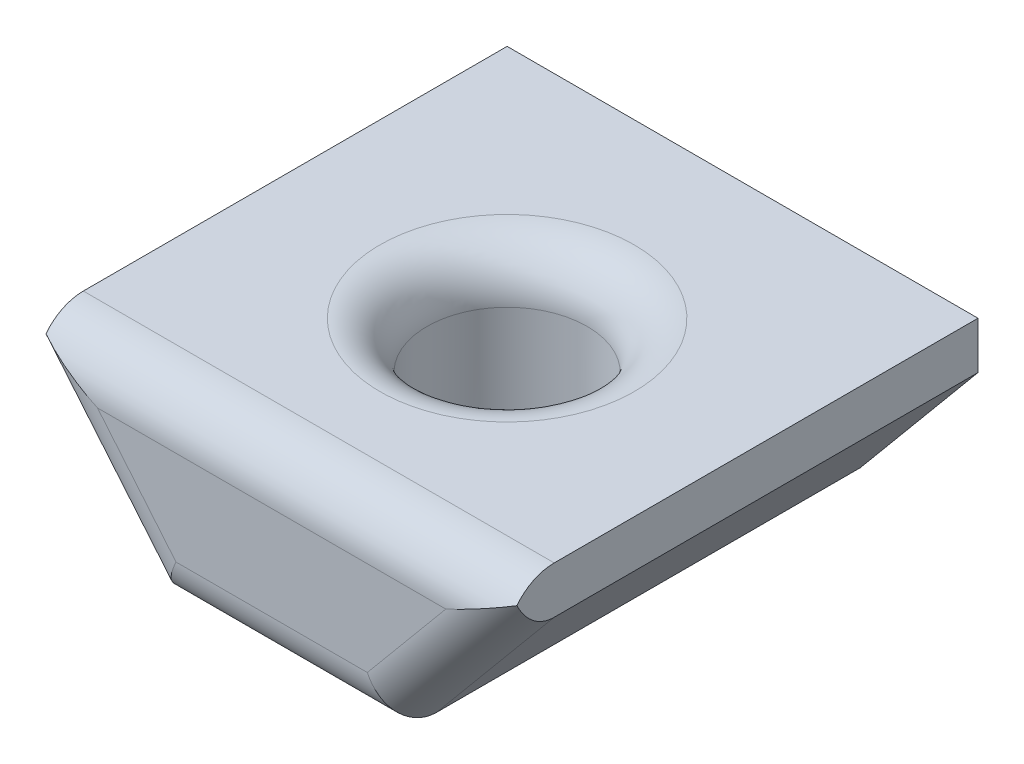
ISO-10303-21;
HEADER;
FILE_DESCRIPTION(('STEP AP214'),'2;1');
FILE_NAME('part.step','',(''),(''),'','','');
FILE_SCHEMA(('AUTOMOTIVE_DESIGN { 1 0 10303 214 1 1 1 1 }'));
ENDSEC;
DATA;
#1=APPLICATION_CONTEXT('core data for automotive mechanical design processes');
#2=APPLICATION_PROTOCOL_DEFINITION('international standard','automotive_design',2000,#1);
#3=PRODUCT_CONTEXT('',#1,'mechanical');
#4=PRODUCT('Part','Part','',(#3));
#5=PRODUCT_RELATED_PRODUCT_CATEGORY('part','',(#4));
#6=PRODUCT_DEFINITION_FORMATION('','',#4);
#7=PRODUCT_DEFINITION_CONTEXT('part definition',#1,'design');
#8=PRODUCT_DEFINITION('design','',#6,#7);
#9=PRODUCT_DEFINITION_SHAPE('','',#8);
#10=(LENGTH_UNIT() NAMED_UNIT(*) SI_UNIT(.MILLI.,.METRE.));
#11=(NAMED_UNIT(*) PLANE_ANGLE_UNIT() SI_UNIT($,.RADIAN.));
#12=(NAMED_UNIT(*) SI_UNIT($,.STERADIAN.) SOLID_ANGLE_UNIT());
#13=UNCERTAINTY_MEASURE_WITH_UNIT(LENGTH_MEASURE(1.E-05),#10,'distance_accuracy_value','');
#14=(GEOMETRIC_REPRESENTATION_CONTEXT(3) GLOBAL_UNCERTAINTY_ASSIGNED_CONTEXT((#13)) GLOBAL_UNIT_ASSIGNED_CONTEXT((#10,
#11,#12)) REPRESENTATION_CONTEXT('',''));
#15=CARTESIAN_POINT('',(0.,0.,0.));
#16=DIRECTION('',(0.,0.,1.));
#17=DIRECTION('',(1.,0.,0.));
#18=AXIS2_PLACEMENT_3D('',#15,#16,#17);
#19=CARTESIAN_POINT('',(2.5,0.,10.));
#20=DIRECTION('',(-0.768221279597376,0.64018439966448,0.));
#21=DIRECTION('',(-0.64018439966448,-0.768221279597376,0.));
#22=AXIS2_PLACEMENT_3D('',#19,#20,#21);
#23=PLANE('',#22);
#24=DIRECTION('',(0.,0.,-1.));
#25=VECTOR('',#24,1.);
#26=CARTESIAN_POINT('',(5.,3.,10.));
#27=LINE('',#26,#25);
#28=CARTESIAN_POINT('',(5.,3.,9.));
#29=VERTEX_POINT('',#28);
#30=CARTESIAN_POINT('',(5.,3.,0.));
#31=VERTEX_POINT('',#30);
#32=EDGE_CURVE('E112',#29,#31,#27,.T.);
#33=ORIENTED_EDGE('',*,*,#32,.F.);
#34=DIRECTION('',(0.64018439966448,0.768221279597376,0.));
#35=VECTOR('',#34,1.);
#36=CARTESIAN_POINT('',(2.5,0.,9.));
#37=LINE('',#36,#35);
#38=CARTESIAN_POINT('',(2.5,0.,9.));
#39=VERTEX_POINT('',#38);
#40=EDGE_CURVE('E194',#29,#39,#37,.F.);
#41=ORIENTED_EDGE('',*,*,#40,.T.);
#42=DIRECTION('',(0.,0.,-1.));
#43=VECTOR('',#42,1.);
#44=CARTESIAN_POINT('',(2.5,0.,10.));
#45=LINE('',#44,#43);
#46=CARTESIAN_POINT('',(2.5,0.,0.));
#47=VERTEX_POINT('',#46);
#48=EDGE_CURVE('E138',#39,#47,#45,.T.);
#49=ORIENTED_EDGE('',*,*,#48,.T.);
#50=DIRECTION('',(0.64018439966448,0.768221279597376,0.));
#51=VECTOR('',#50,1.);
#52=CARTESIAN_POINT('',(2.5,0.,0.));
#53=LINE('',#52,#51);
#54=EDGE_CURVE('E131',#47,#31,#53,.T.);
#55=ORIENTED_EDGE('',*,*,#54,.T.);
#56=EDGE_LOOP('',(#33,#41,#49,#55));
#57=FACE_BOUND('',#56,.T.);
#58=ADVANCED_FACE('F39',(#57),#23,.F.);
#59=CARTESIAN_POINT('',(5.,3.,10.));
#60=DIRECTION('',(-1.,0.,0.));
#61=DIRECTION('',(0.,-1.,0.));
#62=AXIS2_PLACEMENT_3D('',#59,#60,#61);
#63=PLANE('',#62);
#64=CARTESIAN_POINT('',(5.,3.,9.));
#65=DIRECTION('',(-1.,0.,0.));
#66=DIRECTION('',(0.,-1.,0.));
#67=AXIS2_PLACEMENT_3D('',#64,#65,#66);
#68=CIRCLE('',#67,1.);
#69=CARTESIAN_POINT('',(5.,4.,9.));
#70=VERTEX_POINT('',#69);
#71=CARTESIAN_POINT('',(5.,3.60968754501296,9.79264184689938));
#72=VERTEX_POINT('',#71);
#73=EDGE_CURVE('E189',#70,#72,#68,.F.);
#74=ORIENTED_EDGE('',*,*,#73,.T.);
#75=CARTESIAN_POINT('',(5.,4.56204993518133,9.));
#76=DIRECTION('',(-1.,0.,0.));
#77=DIRECTION('',(0.,-1.,0.));
#78=AXIS2_PLACEMENT_3D('',#75,#76,#77);
#79=ELLIPSE('',#78,1.56204993518133,1.);
#80=EDGE_CURVE('E119',#72,#29,#79,.F.);
#81=ORIENTED_EDGE('',*,*,#80,.T.);
#82=ORIENTED_EDGE('',*,*,#32,.T.);
#83=DIRECTION('',(0.,1.,0.));
#84=VECTOR('',#83,1.);
#85=CARTESIAN_POINT('',(5.,3.,0.));
#86=LINE('',#85,#84);
#87=CARTESIAN_POINT('',(5.,4.,0.));
#88=VERTEX_POINT('',#87);
#89=EDGE_CURVE('E116',#31,#88,#86,.T.);
#90=ORIENTED_EDGE('',*,*,#89,.T.);
#91=DIRECTION('',(0.,0.,-1.));
#92=VECTOR('',#91,1.);
#93=CARTESIAN_POINT('',(5.,4.,10.));
#94=LINE('',#93,#92);
#95=EDGE_CURVE('E125',#70,#88,#94,.T.);
#96=ORIENTED_EDGE('',*,*,#95,.F.);
#97=EDGE_LOOP('',(#74,#81,#82,#90,#96));
#98=FACE_BOUND('',#97,.T.);
#99=ADVANCED_FACE('F114',(#98),#63,.F.);
#100=CARTESIAN_POINT('',(5.,4.,10.));
#101=DIRECTION('',(0.,-1.,0.));
#102=DIRECTION('',(0.,0.,-1.));
#103=AXIS2_PLACEMENT_3D('',#100,#101,#102);
#104=PLANE('',#103);
#105=CARTESIAN_POINT('',(0.,4.,5.));
#106=DIRECTION('',(0.,-1.,0.));
#107=DIRECTION('',(0.,0.,-1.));
#108=AXIS2_PLACEMENT_3D('',#105,#106,#107);
#109=CIRCLE('',#108,2.7);
#110=CARTESIAN_POINT('',(0.,4.,2.3));
#111=VERTEX_POINT('',#110);
#112=EDGE_CURVE('E204',#111,#111,#109,.T.);
#113=ORIENTED_EDGE('',*,*,#112,.T.);
#114=EDGE_LOOP('',(#113));
#115=FACE_BOUND('',#114,.T.);
#116=DIRECTION('',(0.,0.,-1.));
#117=VECTOR('',#116,1.);
#118=CARTESIAN_POINT('',(-5.,4.,10.));
#119=LINE('',#118,#117);
#120=CARTESIAN_POINT('',(-5.,4.,9.));
#121=VERTEX_POINT('',#120);
#122=CARTESIAN_POINT('',(-5.,4.,0.));
#123=VERTEX_POINT('',#122);
#124=EDGE_CURVE('E168',#121,#123,#119,.T.);
#125=ORIENTED_EDGE('',*,*,#124,.F.);
#126=DIRECTION('',(-1.,0.,0.));
#127=VECTOR('',#126,1.);
#128=CARTESIAN_POINT('',(5.,4.,9.));
#129=LINE('',#128,#127);
#130=EDGE_CURVE('E49',#121,#70,#129,.F.);
#131=ORIENTED_EDGE('',*,*,#130,.T.);
#132=ORIENTED_EDGE('',*,*,#95,.T.);
#133=DIRECTION('',(-1.,0.,0.));
#134=VECTOR('',#133,1.);
#135=CARTESIAN_POINT('',(5.,4.,0.));
#136=LINE('',#135,#134);
#137=EDGE_CURVE('E134',#88,#123,#136,.T.);
#138=ORIENTED_EDGE('',*,*,#137,.T.);
#139=EDGE_LOOP('',(#125,#131,#132,#138));
#140=FACE_BOUND('',#139,.T.);
#141=ADVANCED_FACE('F235',(#115,#140),#104,.F.);
#142=CARTESIAN_POINT('',(-5.,3.,10.));
#143=DIRECTION('',(1.,0.,0.));
#144=DIRECTION('',(0.,1.,0.));
#145=AXIS2_PLACEMENT_3D('',#142,#143,#144);
#146=PLANE('',#145);
#147=DIRECTION('',(0.,0.,-1.));
#148=VECTOR('',#147,1.);
#149=CARTESIAN_POINT('',(-5.,3.,10.));
#150=LINE('',#149,#148);
#151=CARTESIAN_POINT('',(-5.,3.,9.));
#152=VERTEX_POINT('',#151);
#153=CARTESIAN_POINT('',(-5.,3.,0.));
#154=VERTEX_POINT('',#153);
#155=EDGE_CURVE('E165',#152,#154,#150,.T.);
#156=ORIENTED_EDGE('',*,*,#155,.F.);
#157=CARTESIAN_POINT('',(-5.,4.56204993518133,9.));
#158=DIRECTION('',(1.,0.,0.));
#159=DIRECTION('',(0.,1.,0.));
#160=AXIS2_PLACEMENT_3D('',#157,#158,#159);
#161=ELLIPSE('',#160,1.56204993518133,1.);
#162=CARTESIAN_POINT('',(-5.,3.60968754501296,9.79264184689938));
#163=VERTEX_POINT('',#162);
#164=EDGE_CURVE('E57',#152,#163,#161,.F.);
#165=ORIENTED_EDGE('',*,*,#164,.T.);
#166=CARTESIAN_POINT('',(-5.,3.,9.));
#167=DIRECTION('',(1.,0.,0.));
#168=DIRECTION('',(0.,1.,0.));
#169=AXIS2_PLACEMENT_3D('',#166,#167,#168);
#170=CIRCLE('',#169,1.);
#171=EDGE_CURVE('E61',#163,#121,#170,.F.);
#172=ORIENTED_EDGE('',*,*,#171,.T.);
#173=ORIENTED_EDGE('',*,*,#124,.T.);
#174=DIRECTION('',(0.,-1.,0.));
#175=VECTOR('',#174,1.);
#176=CARTESIAN_POINT('',(-5.,3.,0.));
#177=LINE('',#176,#175);
#178=EDGE_CURVE('E149',#123,#154,#177,.T.);
#179=ORIENTED_EDGE('',*,*,#178,.T.);
#180=EDGE_LOOP('',(#156,#165,#172,#173,#179));
#181=FACE_BOUND('',#180,.T.);
#182=ADVANCED_FACE('F247',(#181),#146,.F.);
#183=CARTESIAN_POINT('',(-2.5,0.,10.));
#184=DIRECTION('',(0.768221279597376,0.64018439966448,0.));
#185=DIRECTION('',(-0.64018439966448,0.768221279597376,0.));
#186=AXIS2_PLACEMENT_3D('',#183,#184,#185);
#187=PLANE('',#186);
#188=DIRECTION('',(0.,0.,-1.));
#189=VECTOR('',#188,1.);
#190=CARTESIAN_POINT('',(-2.5,0.,10.));
#191=LINE('',#190,#189);
#192=CARTESIAN_POINT('',(-2.5,0.,9.));
#193=VERTEX_POINT('',#192);
#194=CARTESIAN_POINT('',(-2.5,0.,0.));
#195=VERTEX_POINT('',#194);
#196=EDGE_CURVE('E162',#193,#195,#191,.T.);
#197=ORIENTED_EDGE('',*,*,#196,.F.);
#198=DIRECTION('',(0.64018439966448,-0.768221279597376,0.));
#199=VECTOR('',#198,1.);
#200=CARTESIAN_POINT('',(-5.,3.,9.));
#201=LINE('',#200,#199);
#202=EDGE_CURVE('E197',#193,#152,#201,.F.);
#203=ORIENTED_EDGE('',*,*,#202,.T.);
#204=ORIENTED_EDGE('',*,*,#155,.T.);
#205=DIRECTION('',(0.64018439966448,-0.768221279597376,0.));
#206=VECTOR('',#205,1.);
#207=CARTESIAN_POINT('',(-2.5,0.,0.));
#208=LINE('',#207,#206);
#209=EDGE_CURVE('E153',#154,#195,#208,.T.);
#210=ORIENTED_EDGE('',*,*,#209,.T.);
#211=EDGE_LOOP('',(#197,#203,#204,#210));
#212=FACE_BOUND('',#211,.T.);
#213=ADVANCED_FACE('F246',(#212),#187,.F.);
#214=CARTESIAN_POINT('',(-2.5,0.,10.));
#215=DIRECTION('',(0.,1.,0.));
#216=DIRECTION('',(0.,0.,1.));
#217=AXIS2_PLACEMENT_3D('',#214,#215,#216);
#218=PLANE('',#217);
#219=CARTESIAN_POINT('',(0.,0.,5.));
#220=DIRECTION('',(0.,1.,0.));
#221=DIRECTION('',(0.,0.,1.));
#222=AXIS2_PLACEMENT_3D('',#219,#220,#221);
#223=CIRCLE('',#222,1.7);
#224=CARTESIAN_POINT('',(0.,0.,6.7));
#225=VERTEX_POINT('',#224);
#226=EDGE_CURVE('E141',#225,#225,#223,.T.);
#227=ORIENTED_EDGE('',*,*,#226,.T.);
#228=EDGE_LOOP('',(#227));
#229=FACE_BOUND('',#228,.T.);
#230=ORIENTED_EDGE('',*,*,#48,.F.);
#231=DIRECTION('',(1.,0.,0.));
#232=VECTOR('',#231,1.);
#233=CARTESIAN_POINT('',(-2.5,0.,9.));
#234=LINE('',#233,#232);
#235=EDGE_CURVE('E185',#39,#193,#234,.F.);
#236=ORIENTED_EDGE('',*,*,#235,.T.);
#237=ORIENTED_EDGE('',*,*,#196,.T.);
#238=DIRECTION('',(1.,0.,0.));
#239=VECTOR('',#238,1.);
#240=CARTESIAN_POINT('',(-2.5,0.,0.));
#241=LINE('',#240,#239);
#242=EDGE_CURVE('E157',#195,#47,#241,.T.);
#243=ORIENTED_EDGE('',*,*,#242,.T.);
#244=EDGE_LOOP('',(#230,#236,#237,#243));
#245=FACE_BOUND('',#244,.T.);
#246=ADVANCED_FACE('F240',(#229,#245),#218,.F.);
#247=CARTESIAN_POINT('',(0.,0.,10.));
#248=DIRECTION('',(0.,0.,1.));
#249=DIRECTION('',(1.,0.,0.));
#250=AXIS2_PLACEMENT_3D('',#247,#248,#249);
#251=PLANE('',#250);
#252=DIRECTION('',(0.64018439966448,-0.768221279597376,0.));
#253=VECTOR('',#252,1.);
#254=CARTESIAN_POINT('',(-1.73177872040262,0.64018439966448,10.));
#255=LINE('',#254,#253);
#256=CARTESIAN_POINT('',(-3.69829172068223,3.,10.));
#257=VERTEX_POINT('',#256);
#258=CARTESIAN_POINT('',(-2.03162505401556,1.,10.));
#259=VERTEX_POINT('',#258);
#260=EDGE_CURVE('E175',#257,#259,#255,.T.);
#261=ORIENTED_EDGE('',*,*,#260,.T.);
#262=DIRECTION('',(1.,0.,0.));
#263=VECTOR('',#262,1.);
#264=CARTESIAN_POINT('',(2.5,1.,10.));
#265=LINE('',#264,#263);
#266=CARTESIAN_POINT('',(2.03162505401556,1.,10.));
#267=VERTEX_POINT('',#266);
#268=EDGE_CURVE('E181',#259,#267,#265,.T.);
#269=ORIENTED_EDGE('',*,*,#268,.T.);
#270=DIRECTION('',(0.64018439966448,0.768221279597376,0.));
#271=VECTOR('',#270,1.);
#272=CARTESIAN_POINT('',(4.23177872040262,3.64018439966448,10.));
#273=LINE('',#272,#271);
#274=CARTESIAN_POINT('',(3.69829172068222,3.,10.));
#275=VERTEX_POINT('',#274);
#276=EDGE_CURVE('E178',#267,#275,#273,.T.);
#277=ORIENTED_EDGE('',*,*,#276,.T.);
#278=DIRECTION('',(-1.,0.,0.));
#279=VECTOR('',#278,1.);
#280=CARTESIAN_POINT('',(-5.,3.,10.));
#281=LINE('',#280,#279);
#282=EDGE_CURVE('E124',#275,#257,#281,.T.);
#283=ORIENTED_EDGE('',*,*,#282,.T.);
#284=EDGE_LOOP('',(#261,#269,#277,#283));
#285=FACE_BOUND('',#284,.T.);
#286=ADVANCED_FACE('F280',(#285),#251,.T.);
#287=CARTESIAN_POINT('',(0.,0.,0.));
#288=DIRECTION('',(0.,0.,1.));
#289=DIRECTION('',(1.,0.,0.));
#290=AXIS2_PLACEMENT_3D('',#287,#288,#289);
#291=PLANE('',#290);
#292=ORIENTED_EDGE('',*,*,#54,.F.);
#293=ORIENTED_EDGE('',*,*,#242,.F.);
#294=ORIENTED_EDGE('',*,*,#209,.F.);
#295=ORIENTED_EDGE('',*,*,#178,.F.);
#296=ORIENTED_EDGE('',*,*,#137,.F.);
#297=ORIENTED_EDGE('',*,*,#89,.F.);
#298=EDGE_LOOP('',(#292,#293,#294,#295,#296,#297));
#299=FACE_BOUND('',#298,.T.);
#300=ADVANCED_FACE('F129',(#299),#291,.F.);
#301=CARTESIAN_POINT('',(0.,0.,5.));
#302=DIRECTION('',(0.,1.,0.));
#303=DIRECTION('',(0.,0.,1.));
#304=AXIS2_PLACEMENT_3D('',#301,#302,#303);
#305=CYLINDRICAL_SURFACE('',#304,1.7);
#306=CARTESIAN_POINT('',(0.,3.,5.));
#307=DIRECTION('',(0.,-1.,0.));
#308=DIRECTION('',(0.,0.,-1.));
#309=AXIS2_PLACEMENT_3D('',#306,#307,#308);
#310=CIRCLE('',#309,1.7);
#311=CARTESIAN_POINT('',(0.,3.,3.3));
#312=VERTEX_POINT('',#311);
#313=EDGE_CURVE('E11',#312,#312,#310,.F.);
#314=ORIENTED_EDGE('',*,*,#313,.T.);
#315=EDGE_LOOP('',(#314));
#316=FACE_BOUND('',#315,.T.);
#317=ORIENTED_EDGE('',*,*,#226,.F.);
#318=EDGE_LOOP('',(#317));
#319=FACE_BOUND('',#318,.T.);
#320=ADVANCED_FACE('F271',(#316,#319),#305,.F.);
#321=CARTESIAN_POINT('',(0.,3.,9.));
#322=DIRECTION('',(1.,0.,0.));
#323=DIRECTION('',(0.,0.,-1.));
#324=AXIS2_PLACEMENT_3D('',#321,#322,#323);
#325=CYLINDRICAL_SURFACE('',#324,1.);
#326=ORIENTED_EDGE('',*,*,#130,.F.);
#327=ORIENTED_EDGE('',*,*,#171,.F.);
#328=CARTESIAN_POINT('',(-3.69829172068222,3.,9.));
#329=DIRECTION('',(0.424155396249724,0.90558942122368,0.));
#330=DIRECTION('',(-0.90558942122368,0.424155396249724,0.));
#331=AXIS2_PLACEMENT_3D('',#328,#329,#330);
#332=ELLIPSE('',#331,2.35762649453891,1.);
#333=EDGE_CURVE('E43',#257,#163,#332,.F.);
#334=ORIENTED_EDGE('',*,*,#333,.F.);
#335=ORIENTED_EDGE('',*,*,#282,.F.);
#336=CARTESIAN_POINT('',(3.69829172068222,3.,9.));
#337=DIRECTION('',(0.424155396249724,-0.90558942122368,0.));
#338=DIRECTION('',(0.90558942122368,0.424155396249724,0.));
#339=AXIS2_PLACEMENT_3D('',#336,#337,#338);
#340=ELLIPSE('',#339,2.35762649453891,1.);
#341=EDGE_CURVE('E215',#72,#275,#340,.T.);
#342=ORIENTED_EDGE('',*,*,#341,.F.);
#343=ORIENTED_EDGE('',*,*,#73,.F.);
#344=EDGE_LOOP('',(#326,#327,#334,#335,#342,#343));
#345=FACE_BOUND('',#344,.T.);
#346=ADVANCED_FACE('F232',(#345),#325,.T.);
#347=CARTESIAN_POINT('',(-0.707188556468198,-0.589323797056832,9.));
#348=DIRECTION('',(-0.64018439966448,0.768221279597376,0.));
#349=DIRECTION('',(-0.768221279597376,-0.64018439966448,0.));
#350=AXIS2_PLACEMENT_3D('',#347,#348,#349);
#351=CYLINDRICAL_SURFACE('',#350,1.);
#352=ORIENTED_EDGE('',*,*,#164,.F.);
#353=ORIENTED_EDGE('',*,*,#202,.F.);
#354=CARTESIAN_POINT('',(-2.03162505401556,1.,9.));
#355=DIRECTION('',(-0.90558942122368,0.424155396249724,0.));
#356=DIRECTION('',(0.424155396249724,0.90558942122368,0.));
#357=AXIS2_PLACEMENT_3D('',#354,#355,#356);
#358=ELLIPSE('',#357,1.10425318203115,1.);
#359=EDGE_CURVE('E213',#259,#193,#358,.F.);
#360=ORIENTED_EDGE('',*,*,#359,.F.);
#361=ORIENTED_EDGE('',*,*,#260,.F.);
#362=ORIENTED_EDGE('',*,*,#333,.T.);
#363=EDGE_LOOP('',(#352,#353,#360,#361,#362));
#364=FACE_BOUND('',#363,.T.);
#365=ADVANCED_FACE('F226',(#364),#351,.T.);
#366=CARTESIAN_POINT('',(0.707188556468198,-0.589323797056832,9.));
#367=DIRECTION('',(-0.64018439966448,-0.768221279597376,0.));
#368=DIRECTION('',(0.768221279597376,-0.64018439966448,0.));
#369=AXIS2_PLACEMENT_3D('',#366,#367,#368);
#370=CYLINDRICAL_SURFACE('',#369,1.);
#371=ORIENTED_EDGE('',*,*,#341,.T.);
#372=ORIENTED_EDGE('',*,*,#276,.F.);
#373=CARTESIAN_POINT('',(2.03162505401556,1.,9.));
#374=DIRECTION('',(-0.90558942122368,-0.424155396249724,0.));
#375=DIRECTION('',(0.424155396249724,-0.90558942122368,0.));
#376=AXIS2_PLACEMENT_3D('',#373,#374,#375);
#377=ELLIPSE('',#376,1.10425318203115,1.);
#378=EDGE_CURVE('E210',#39,#267,#377,.T.);
#379=ORIENTED_EDGE('',*,*,#378,.F.);
#380=ORIENTED_EDGE('',*,*,#40,.F.);
#381=ORIENTED_EDGE('',*,*,#80,.F.);
#382=EDGE_LOOP('',(#371,#372,#379,#380,#381));
#383=FACE_BOUND('',#382,.T.);
#384=ADVANCED_FACE('F236',(#383),#370,.T.);
#385=CARTESIAN_POINT('',(0.,1.,9.));
#386=DIRECTION('',(-1.,0.,0.));
#387=DIRECTION('',(0.,0.,1.));
#388=AXIS2_PLACEMENT_3D('',#385,#386,#387);
#389=CYLINDRICAL_SURFACE('',#388,1.);
#390=ORIENTED_EDGE('',*,*,#359,.T.);
#391=ORIENTED_EDGE('',*,*,#235,.F.);
#392=ORIENTED_EDGE('',*,*,#378,.T.);
#393=ORIENTED_EDGE('',*,*,#268,.F.);
#394=EDGE_LOOP('',(#390,#391,#392,#393));
#395=FACE_BOUND('',#394,.T.);
#396=ADVANCED_FACE('F243',(#395),#389,.T.);
#397=CARTESIAN_POINT('',(0.,3.,5.));
#398=DIRECTION('',(0.,-1.,0.));
#399=DIRECTION('',(0.,0.,-1.));
#400=AXIS2_PLACEMENT_3D('',#397,#398,#399);
#401=TOROIDAL_SURFACE('',#400,2.7,1.);
#402=ORIENTED_EDGE('',*,*,#112,.F.);
#403=EDGE_LOOP('',(#402));
#404=FACE_BOUND('',#403,.T.);
#405=ORIENTED_EDGE('',*,*,#313,.F.);
#406=EDGE_LOOP('',(#405));
#407=FACE_BOUND('',#406,.T.);
#408=ADVANCED_FACE('F41',(#404,#407),#401,.T.);
#409=CLOSED_SHELL('',(#58,#99,#141,#182,#213,#246,#286,#300,#320,#346,#365,#384,#396,#408));
#410=MANIFOLD_SOLID_BREP('B2',#409);
#411=ADVANCED_BREP_SHAPE_REPRESENTATION('',(#18,#410),#14);
#412=SHAPE_DEFINITION_REPRESENTATION(#9,#411);
ENDSEC;
END-ISO-10303-21;
